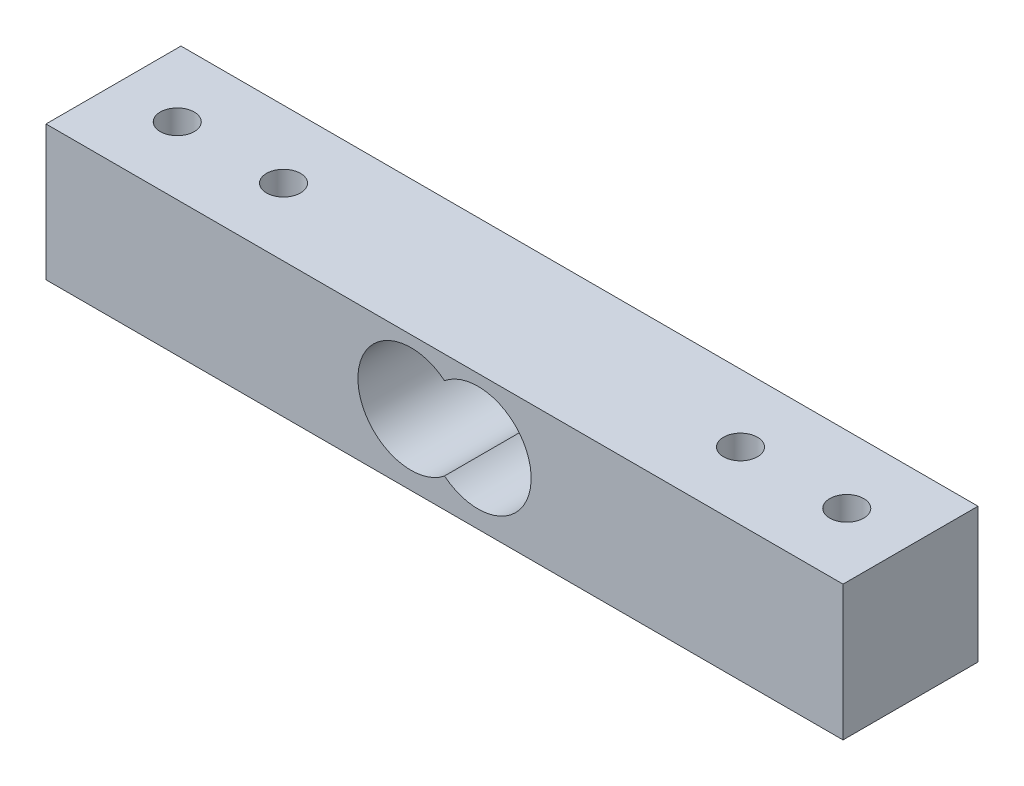
ISO-10303-21;
HEADER;
FILE_DESCRIPTION(('STEP AP214'),'2;1');
FILE_NAME('part.step','',(''),(''),'','','');
FILE_SCHEMA(('AUTOMOTIVE_DESIGN { 1 0 10303 214 1 1 1 1 }'));
ENDSEC;
DATA;
#1=APPLICATION_CONTEXT('core data for automotive mechanical design processes');
#2=APPLICATION_PROTOCOL_DEFINITION('international standard','automotive_design',2000,#1);
#3=PRODUCT_CONTEXT('',#1,'mechanical');
#4=PRODUCT('Part','Part','',(#3));
#5=PRODUCT_RELATED_PRODUCT_CATEGORY('part','',(#4));
#6=PRODUCT_DEFINITION_FORMATION('','',#4);
#7=PRODUCT_DEFINITION_CONTEXT('part definition',#1,'design');
#8=PRODUCT_DEFINITION('design','',#6,#7);
#9=PRODUCT_DEFINITION_SHAPE('','',#8);
#10=(LENGTH_UNIT() NAMED_UNIT(*) SI_UNIT(.MILLI.,.METRE.));
#11=(NAMED_UNIT(*) PLANE_ANGLE_UNIT() SI_UNIT($,.RADIAN.));
#12=(NAMED_UNIT(*) SI_UNIT($,.STERADIAN.) SOLID_ANGLE_UNIT());
#13=UNCERTAINTY_MEASURE_WITH_UNIT(LENGTH_MEASURE(1.E-05),#10,'distance_accuracy_value','');
#14=(GEOMETRIC_REPRESENTATION_CONTEXT(3) GLOBAL_UNCERTAINTY_ASSIGNED_CONTEXT((#13)) GLOBAL_UNIT_ASSIGNED_CONTEXT((#10,
#11,#12)) REPRESENTATION_CONTEXT('',''));
#15=CARTESIAN_POINT('',(0.,0.,0.));
#16=DIRECTION('',(0.,0.,1.));
#17=DIRECTION('',(1.,0.,0.));
#18=AXIS2_PLACEMENT_3D('',#15,#16,#17);
#19=CARTESIAN_POINT('',(-26.2255,12.7,-6.57225));
#20=DIRECTION('',(1.,0.,0.));
#21=DIRECTION('',(0.,0.,-1.));
#22=AXIS2_PLACEMENT_3D('',#19,#20,#21);
#23=PLANE('',#22);
#24=DIRECTION('',(0.,0.,1.));
#25=VECTOR('',#24,1.);
#26=CARTESIAN_POINT('',(-26.2255,0.,-6.57225));
#27=LINE('',#26,#25);
#28=CARTESIAN_POINT('',(-26.2255,0.,-6.57225));
#29=VERTEX_POINT('',#28);
#30=CARTESIAN_POINT('',(-26.2255,0.,6.12775));
#31=VERTEX_POINT('',#30);
#32=EDGE_CURVE('E105',#29,#31,#27,.T.);
#33=ORIENTED_EDGE('',*,*,#32,.T.);
#34=DIRECTION('',(0.,-1.,0.));
#35=VECTOR('',#34,1.);
#36=CARTESIAN_POINT('',(-26.2255,12.7,6.12775));
#37=LINE('',#36,#35);
#38=CARTESIAN_POINT('',(-26.2255,12.7,6.12775));
#39=VERTEX_POINT('',#38);
#40=EDGE_CURVE('E11',#39,#31,#37,.T.);
#41=ORIENTED_EDGE('',*,*,#40,.F.);
#42=DIRECTION('',(0.,0.,1.));
#43=VECTOR('',#42,1.);
#44=CARTESIAN_POINT('',(-26.2255,12.7,-6.57225));
#45=LINE('',#44,#43);
#46=CARTESIAN_POINT('',(-26.2255,12.7,-6.57225));
#47=VERTEX_POINT('',#46);
#48=EDGE_CURVE('E107',#47,#39,#45,.T.);
#49=ORIENTED_EDGE('',*,*,#48,.F.);
#50=DIRECTION('',(0.,-1.,0.));
#51=VECTOR('',#50,1.);
#52=CARTESIAN_POINT('',(-26.2255,12.7,-6.57225));
#53=LINE('',#52,#51);
#54=EDGE_CURVE('E117',#47,#29,#53,.T.);
#55=ORIENTED_EDGE('',*,*,#54,.T.);
#56=EDGE_LOOP('',(#33,#41,#49,#55));
#57=FACE_BOUND('',#56,.T.);
#58=ADVANCED_FACE('F33',(#57),#23,.F.);
#59=CARTESIAN_POINT('',(-26.2255,12.7,6.12775));
#60=DIRECTION('',(0.,0.,-1.));
#61=DIRECTION('',(-1.,0.,0.));
#62=AXIS2_PLACEMENT_3D('',#59,#60,#61);
#63=PLANE('',#62);
#64=CARTESIAN_POINT('',(14.4245,6.64825358545086,6.12775));
#65=DIRECTION('',(0.,0.,1.));
#66=DIRECTION('',(1.,0.,0.));
#67=AXIS2_PLACEMENT_3D('',#64,#65,#66);
#68=CIRCLE('',#67,5.);
#69=CARTESIAN_POINT('',(11.2745,2.76527792238007,6.12775));
#70=VERTEX_POINT('',#69);
#71=CARTESIAN_POINT('',(11.2745,10.5312292485216,6.12775));
#72=VERTEX_POINT('',#71);
#73=EDGE_CURVE('E96',#70,#72,#68,.T.);
#74=ORIENTED_EDGE('',*,*,#73,.F.);
#75=CARTESIAN_POINT('',(8.12450000000001,6.64825358545086,6.12775));
#76=DIRECTION('',(0.,0.,1.));
#77=DIRECTION('',(1.,0.,0.));
#78=AXIS2_PLACEMENT_3D('',#75,#76,#77);
#79=CIRCLE('',#78,5.);
#80=EDGE_CURVE('E47',#72,#70,#79,.T.);
#81=ORIENTED_EDGE('',*,*,#80,.F.);
#82=EDGE_LOOP('',(#74,#81));
#83=FACE_BOUND('',#82,.T.);
#84=DIRECTION('',(1.,0.,0.));
#85=VECTOR('',#84,1.);
#86=CARTESIAN_POINT('',(-26.2255,0.,6.12775));
#87=LINE('',#86,#85);
#88=CARTESIAN_POINT('',(48.7745,0.,6.12775));
#89=VERTEX_POINT('',#88);
#90=EDGE_CURVE('E120',#31,#89,#87,.T.);
#91=ORIENTED_EDGE('',*,*,#90,.T.);
#92=DIRECTION('',(0.,-1.,0.));
#93=VECTOR('',#92,1.);
#94=CARTESIAN_POINT('',(48.7745,12.7,6.12775));
#95=LINE('',#94,#93);
#96=CARTESIAN_POINT('',(48.7745,12.7,6.12775));
#97=VERTEX_POINT('',#96);
#98=EDGE_CURVE('E40',#97,#89,#95,.T.);
#99=ORIENTED_EDGE('',*,*,#98,.F.);
#100=DIRECTION('',(1.,0.,0.));
#101=VECTOR('',#100,1.);
#102=CARTESIAN_POINT('',(-26.2255,12.7,6.12775));
#103=LINE('',#102,#101);
#104=EDGE_CURVE('E110',#39,#97,#103,.T.);
#105=ORIENTED_EDGE('',*,*,#104,.F.);
#106=ORIENTED_EDGE('',*,*,#40,.T.);
#107=EDGE_LOOP('',(#91,#99,#105,#106));
#108=FACE_BOUND('',#107,.T.);
#109=ADVANCED_FACE('F148',(#83,#108),#63,.F.);
#110=CARTESIAN_POINT('',(48.7745,12.7,-6.57225));
#111=DIRECTION('',(-1.,0.,0.));
#112=DIRECTION('',(0.,0.,1.));
#113=AXIS2_PLACEMENT_3D('',#110,#111,#112);
#114=PLANE('',#113);
#115=DIRECTION('',(0.,0.,-1.));
#116=VECTOR('',#115,1.);
#117=CARTESIAN_POINT('',(48.7745,0.,-6.57225));
#118=LINE('',#117,#116);
#119=CARTESIAN_POINT('',(48.7745,0.,-6.57225));
#120=VERTEX_POINT('',#119);
#121=EDGE_CURVE('E122',#89,#120,#118,.T.);
#122=ORIENTED_EDGE('',*,*,#121,.T.);
#123=DIRECTION('',(0.,-1.,0.));
#124=VECTOR('',#123,1.);
#125=CARTESIAN_POINT('',(48.7745,12.7,-6.57225));
#126=LINE('',#125,#124);
#127=CARTESIAN_POINT('',(48.7745,12.7,-6.57225));
#128=VERTEX_POINT('',#127);
#129=EDGE_CURVE('E127',#128,#120,#126,.T.);
#130=ORIENTED_EDGE('',*,*,#129,.F.);
#131=DIRECTION('',(0.,0.,-1.));
#132=VECTOR('',#131,1.);
#133=CARTESIAN_POINT('',(48.7745,12.7,-6.57225));
#134=LINE('',#133,#132);
#135=EDGE_CURVE('E113',#97,#128,#134,.T.);
#136=ORIENTED_EDGE('',*,*,#135,.F.);
#137=ORIENTED_EDGE('',*,*,#98,.T.);
#138=EDGE_LOOP('',(#122,#130,#136,#137));
#139=FACE_BOUND('',#138,.T.);
#140=ADVANCED_FACE('F134',(#139),#114,.F.);
#141=CARTESIAN_POINT('',(-26.2255,12.7,-6.57225));
#142=DIRECTION('',(0.,0.,1.));
#143=DIRECTION('',(1.,0.,0.));
#144=AXIS2_PLACEMENT_3D('',#141,#142,#143);
#145=PLANE('',#144);
#146=CARTESIAN_POINT('',(14.4245,6.64825358545086,-6.57225));
#147=DIRECTION('',(0.,0.,1.));
#148=DIRECTION('',(1.,0.,0.));
#149=AXIS2_PLACEMENT_3D('',#146,#147,#148);
#150=CIRCLE('',#149,5.);
#151=CARTESIAN_POINT('',(11.2745,2.76527792238007,-6.57225));
#152=VERTEX_POINT('',#151);
#153=CARTESIAN_POINT('',(11.2745,10.5312292485216,-6.57225));
#154=VERTEX_POINT('',#153);
#155=EDGE_CURVE('E88',#152,#154,#150,.T.);
#156=ORIENTED_EDGE('',*,*,#155,.T.);
#157=CARTESIAN_POINT('',(8.12450000000001,6.64825358545086,-6.57225));
#158=DIRECTION('',(0.,0.,1.));
#159=DIRECTION('',(1.,0.,0.));
#160=AXIS2_PLACEMENT_3D('',#157,#158,#159);
#161=CIRCLE('',#160,5.);
#162=EDGE_CURVE('E52',#154,#152,#161,.T.);
#163=ORIENTED_EDGE('',*,*,#162,.T.);
#164=EDGE_LOOP('',(#156,#163));
#165=FACE_BOUND('',#164,.T.);
#166=DIRECTION('',(-1.,0.,0.));
#167=VECTOR('',#166,1.);
#168=CARTESIAN_POINT('',(-26.2255,0.,-6.57225));
#169=LINE('',#168,#167);
#170=EDGE_CURVE('E111',#120,#29,#169,.T.);
#171=ORIENTED_EDGE('',*,*,#170,.T.);
#172=ORIENTED_EDGE('',*,*,#54,.F.);
#173=DIRECTION('',(-1.,0.,0.));
#174=VECTOR('',#173,1.);
#175=CARTESIAN_POINT('',(-26.2255,12.7,-6.57225));
#176=LINE('',#175,#174);
#177=EDGE_CURVE('E115',#128,#47,#176,.T.);
#178=ORIENTED_EDGE('',*,*,#177,.F.);
#179=ORIENTED_EDGE('',*,*,#129,.T.);
#180=EDGE_LOOP('',(#171,#172,#178,#179));
#181=FACE_BOUND('',#180,.T.);
#182=ADVANCED_FACE('F94',(#165,#181),#145,.F.);
#183=CARTESIAN_POINT('',(0.,12.7,0.));
#184=DIRECTION('',(0.,1.,0.));
#185=DIRECTION('',(0.,0.,1.));
#186=AXIS2_PLACEMENT_3D('',#183,#184,#185);
#187=PLANE('',#186);
#188=CARTESIAN_POINT('',(-20.2255,12.7,-0.22225));
#189=DIRECTION('',(0.,1.,0.));
#190=DIRECTION('',(0.,0.,1.));
#191=AXIS2_PLACEMENT_3D('',#188,#189,#190);
#192=CIRCLE('',#191,1.6);
#193=CARTESIAN_POINT('',(-20.2255,12.7,1.37775));
#194=VERTEX_POINT('',#193);
#195=EDGE_CURVE('E191',#194,#194,#192,.T.);
#196=ORIENTED_EDGE('',*,*,#195,.F.);
#197=EDGE_LOOP('',(#196));
#198=FACE_BOUND('',#197,.T.);
#199=CARTESIAN_POINT('',(-10.2255,12.7,-0.22224999999999));
#200=DIRECTION('',(0.,1.,0.));
#201=DIRECTION('',(0.,0.,1.));
#202=AXIS2_PLACEMENT_3D('',#199,#200,#201);
#203=CIRCLE('',#202,1.6);
#204=CARTESIAN_POINT('',(-10.2255,12.7,1.37775000000001));
#205=VERTEX_POINT('',#204);
#206=EDGE_CURVE('E196',#205,#205,#203,.T.);
#207=ORIENTED_EDGE('',*,*,#206,.F.);
#208=EDGE_LOOP('',(#207));
#209=FACE_BOUND('',#208,.T.);
#210=CARTESIAN_POINT('',(32.7745,12.7,-0.22224999999999));
#211=DIRECTION('',(0.,1.,0.));
#212=DIRECTION('',(0.,0.,1.));
#213=AXIS2_PLACEMENT_3D('',#210,#211,#212);
#214=CIRCLE('',#213,1.6);
#215=CARTESIAN_POINT('',(32.7745,12.7,1.37775000000001));
#216=VERTEX_POINT('',#215);
#217=EDGE_CURVE('E204',#216,#216,#214,.T.);
#218=ORIENTED_EDGE('',*,*,#217,.F.);
#219=EDGE_LOOP('',(#218));
#220=FACE_BOUND('',#219,.T.);
#221=CARTESIAN_POINT('',(42.7745,12.7,-0.22224999999999));
#222=DIRECTION('',(0.,1.,0.));
#223=DIRECTION('',(0.,0.,1.));
#224=AXIS2_PLACEMENT_3D('',#221,#222,#223);
#225=CIRCLE('',#224,1.6);
#226=CARTESIAN_POINT('',(42.7745,12.7,1.37775000000001));
#227=VERTEX_POINT('',#226);
#228=EDGE_CURVE('E100',#227,#227,#225,.T.);
#229=ORIENTED_EDGE('',*,*,#228,.F.);
#230=EDGE_LOOP('',(#229));
#231=FACE_BOUND('',#230,.T.);
#232=ORIENTED_EDGE('',*,*,#48,.T.);
#233=ORIENTED_EDGE('',*,*,#104,.T.);
#234=ORIENTED_EDGE('',*,*,#135,.T.);
#235=ORIENTED_EDGE('',*,*,#177,.T.);
#236=EDGE_LOOP('',(#232,#233,#234,#235));
#237=FACE_BOUND('',#236,.T.);
#238=ADVANCED_FACE('F147',(#198,#209,#220,#231,#237),#187,.T.);
#239=CARTESIAN_POINT('',(0.,0.,0.));
#240=DIRECTION('',(0.,1.,0.));
#241=DIRECTION('',(0.,0.,1.));
#242=AXIS2_PLACEMENT_3D('',#239,#240,#241);
#243=PLANE('',#242);
#244=CARTESIAN_POINT('',(-20.2255,0.,-0.22225));
#245=DIRECTION('',(0.,1.,0.));
#246=DIRECTION('',(0.,0.,1.));
#247=AXIS2_PLACEMENT_3D('',#244,#245,#246);
#248=CIRCLE('',#247,1.6);
#249=CARTESIAN_POINT('',(-20.2255,0.,1.37775));
#250=VERTEX_POINT('',#249);
#251=EDGE_CURVE('E103',#250,#250,#248,.T.);
#252=ORIENTED_EDGE('',*,*,#251,.T.);
#253=EDGE_LOOP('',(#252));
#254=FACE_BOUND('',#253,.T.);
#255=CARTESIAN_POINT('',(-10.2255,0.,-0.22224999999999));
#256=DIRECTION('',(0.,1.,0.));
#257=DIRECTION('',(0.,0.,1.));
#258=AXIS2_PLACEMENT_3D('',#255,#256,#257);
#259=CIRCLE('',#258,1.6);
#260=CARTESIAN_POINT('',(-10.2255,0.,1.37775000000001));
#261=VERTEX_POINT('',#260);
#262=EDGE_CURVE('E192',#261,#261,#259,.T.);
#263=ORIENTED_EDGE('',*,*,#262,.T.);
#264=EDGE_LOOP('',(#263));
#265=FACE_BOUND('',#264,.T.);
#266=CARTESIAN_POINT('',(32.7745,0.,-0.22224999999999));
#267=DIRECTION('',(0.,1.,0.));
#268=DIRECTION('',(0.,0.,1.));
#269=AXIS2_PLACEMENT_3D('',#266,#267,#268);
#270=CIRCLE('',#269,1.6);
#271=CARTESIAN_POINT('',(32.7745,0.,1.37775000000001));
#272=VERTEX_POINT('',#271);
#273=EDGE_CURVE('E201',#272,#272,#270,.T.);
#274=ORIENTED_EDGE('',*,*,#273,.T.);
#275=EDGE_LOOP('',(#274));
#276=FACE_BOUND('',#275,.T.);
#277=CARTESIAN_POINT('',(42.7745,0.,-0.22224999999999));
#278=DIRECTION('',(0.,1.,0.));
#279=DIRECTION('',(0.,0.,1.));
#280=AXIS2_PLACEMENT_3D('',#277,#278,#279);
#281=CIRCLE('',#280,1.6);
#282=CARTESIAN_POINT('',(42.7745,0.,1.37775000000001));
#283=VERTEX_POINT('',#282);
#284=EDGE_CURVE('E206',#283,#283,#281,.T.);
#285=ORIENTED_EDGE('',*,*,#284,.T.);
#286=EDGE_LOOP('',(#285));
#287=FACE_BOUND('',#286,.T.);
#288=ORIENTED_EDGE('',*,*,#32,.F.);
#289=ORIENTED_EDGE('',*,*,#170,.F.);
#290=ORIENTED_EDGE('',*,*,#121,.F.);
#291=ORIENTED_EDGE('',*,*,#90,.F.);
#292=EDGE_LOOP('',(#288,#289,#290,#291));
#293=FACE_BOUND('',#292,.T.);
#294=ADVANCED_FACE('F140',(#254,#265,#276,#287,#293),#243,.F.);
#295=CARTESIAN_POINT('',(8.12450000000001,6.64825358545086,-6.57225));
#296=DIRECTION('',(0.,0.,1.));
#297=DIRECTION('',(1.,0.,0.));
#298=AXIS2_PLACEMENT_3D('',#295,#296,#297);
#299=CYLINDRICAL_SURFACE('',#298,5.);
#300=ORIENTED_EDGE('',*,*,#80,.T.);
#301=DIRECTION('',(0.,0.,1.));
#302=VECTOR('',#301,1.);
#303=CARTESIAN_POINT('',(11.2745,2.76527792238007,-6.57225));
#304=LINE('',#303,#302);
#305=EDGE_CURVE('E81',#152,#70,#304,.T.);
#306=ORIENTED_EDGE('',*,*,#305,.F.);
#307=ORIENTED_EDGE('',*,*,#162,.F.);
#308=DIRECTION('',(0.,0.,1.));
#309=VECTOR('',#308,1.);
#310=CARTESIAN_POINT('',(11.2745,10.5312292485216,-6.57225));
#311=LINE('',#310,#309);
#312=EDGE_CURVE('E87',#154,#72,#311,.T.);
#313=ORIENTED_EDGE('',*,*,#312,.T.);
#314=EDGE_LOOP('',(#300,#306,#307,#313));
#315=FACE_BOUND('',#314,.T.);
#316=ADVANCED_FACE('F83',(#315),#299,.F.);
#317=CARTESIAN_POINT('',(14.4245,6.64825358545086,-6.57225));
#318=DIRECTION('',(0.,0.,1.));
#319=DIRECTION('',(1.,0.,0.));
#320=AXIS2_PLACEMENT_3D('',#317,#318,#319);
#321=CYLINDRICAL_SURFACE('',#320,5.);
#322=ORIENTED_EDGE('',*,*,#73,.T.);
#323=ORIENTED_EDGE('',*,*,#312,.F.);
#324=ORIENTED_EDGE('',*,*,#155,.F.);
#325=ORIENTED_EDGE('',*,*,#305,.T.);
#326=EDGE_LOOP('',(#322,#323,#324,#325));
#327=FACE_BOUND('',#326,.T.);
#328=ADVANCED_FACE('F91',(#327),#321,.F.);
#329=CARTESIAN_POINT('',(42.7745,0.,-0.22224999999999));
#330=DIRECTION('',(0.,1.,0.));
#331=DIRECTION('',(0.,0.,1.));
#332=AXIS2_PLACEMENT_3D('',#329,#330,#331);
#333=CYLINDRICAL_SURFACE('',#332,1.6);
#334=ORIENTED_EDGE('',*,*,#284,.F.);
#335=EDGE_LOOP('',(#334));
#336=FACE_BOUND('',#335,.T.);
#337=ORIENTED_EDGE('',*,*,#228,.T.);
#338=EDGE_LOOP('',(#337));
#339=FACE_BOUND('',#338,.T.);
#340=ADVANCED_FACE('F169',(#336,#339),#333,.F.);
#341=CARTESIAN_POINT('',(32.7745,0.,-0.22224999999999));
#342=DIRECTION('',(0.,1.,0.));
#343=DIRECTION('',(0.,0.,1.));
#344=AXIS2_PLACEMENT_3D('',#341,#342,#343);
#345=CYLINDRICAL_SURFACE('',#344,1.6);
#346=ORIENTED_EDGE('',*,*,#273,.F.);
#347=EDGE_LOOP('',(#346));
#348=FACE_BOUND('',#347,.T.);
#349=ORIENTED_EDGE('',*,*,#217,.T.);
#350=EDGE_LOOP('',(#349));
#351=FACE_BOUND('',#350,.T.);
#352=ADVANCED_FACE('F172',(#348,#351),#345,.F.);
#353=CARTESIAN_POINT('',(-10.2255,0.,-0.22224999999999));
#354=DIRECTION('',(0.,1.,0.));
#355=DIRECTION('',(0.,0.,1.));
#356=AXIS2_PLACEMENT_3D('',#353,#354,#355);
#357=CYLINDRICAL_SURFACE('',#356,1.6);
#358=ORIENTED_EDGE('',*,*,#262,.F.);
#359=EDGE_LOOP('',(#358));
#360=FACE_BOUND('',#359,.T.);
#361=ORIENTED_EDGE('',*,*,#206,.T.);
#362=EDGE_LOOP('',(#361));
#363=FACE_BOUND('',#362,.T.);
#364=ADVANCED_FACE('F176',(#360,#363),#357,.F.);
#365=CARTESIAN_POINT('',(-20.2255,0.,-0.22225));
#366=DIRECTION('',(0.,1.,0.));
#367=DIRECTION('',(0.,0.,1.));
#368=AXIS2_PLACEMENT_3D('',#365,#366,#367);
#369=CYLINDRICAL_SURFACE('',#368,1.6);
#370=ORIENTED_EDGE('',*,*,#251,.F.);
#371=EDGE_LOOP('',(#370));
#372=FACE_BOUND('',#371,.T.);
#373=ORIENTED_EDGE('',*,*,#195,.T.);
#374=EDGE_LOOP('',(#373));
#375=FACE_BOUND('',#374,.T.);
#376=ADVANCED_FACE('F180',(#372,#375),#369,.F.);
#377=CLOSED_SHELL('',(#58,#109,#140,#182,#238,#294,#316,#328,#340,#352,#364,#376));
#378=MANIFOLD_SOLID_BREP('B2',#377);
#379=ADVANCED_BREP_SHAPE_REPRESENTATION('',(#18,#378),#14);
#380=SHAPE_DEFINITION_REPRESENTATION(#9,#379);
ENDSEC;
END-ISO-10303-21;
